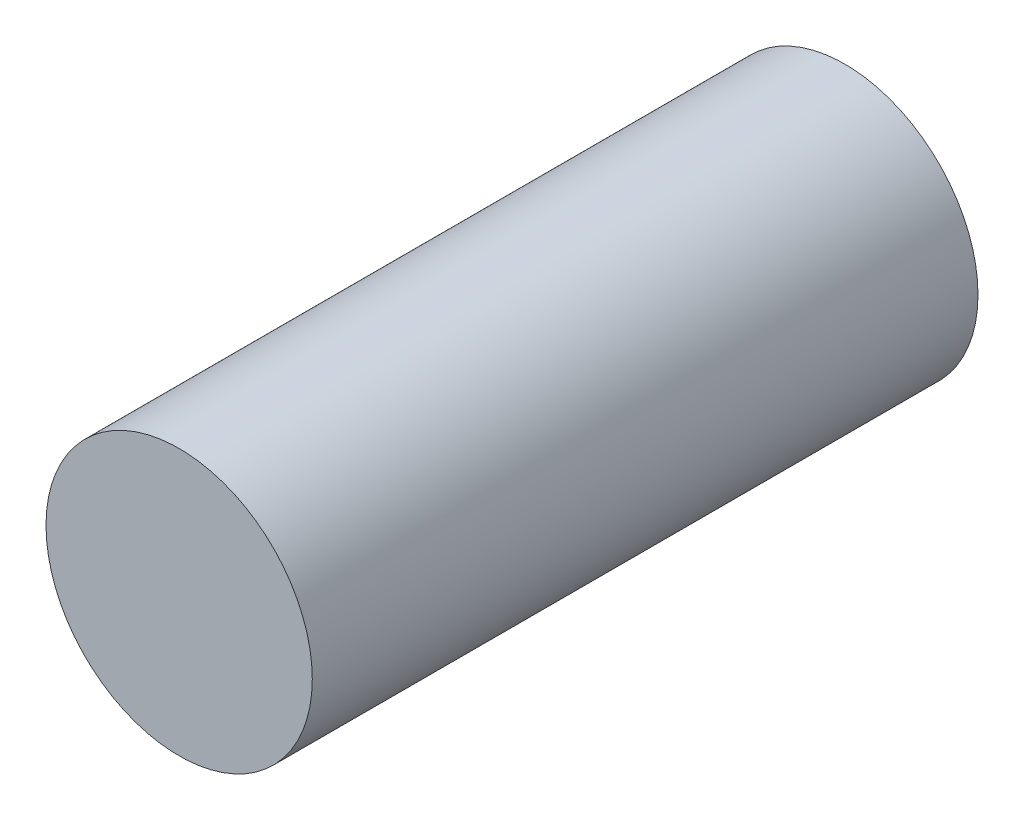
ISO-10303-21;
HEADER;
FILE_DESCRIPTION(('STEP AP214'),'2;1');
FILE_NAME('part.step','',(''),(''),'','','');
FILE_SCHEMA(('AUTOMOTIVE_DESIGN { 1 0 10303 214 1 1 1 1 }'));
ENDSEC;
DATA;
#1=APPLICATION_CONTEXT('core data for automotive mechanical design processes');
#2=APPLICATION_PROTOCOL_DEFINITION('international standard','automotive_design',2000,#1);
#3=PRODUCT_CONTEXT('',#1,'mechanical');
#4=PRODUCT('Part','Part','',(#3));
#5=PRODUCT_RELATED_PRODUCT_CATEGORY('part','',(#4));
#6=PRODUCT_DEFINITION_FORMATION('','',#4);
#7=PRODUCT_DEFINITION_CONTEXT('part definition',#1,'design');
#8=PRODUCT_DEFINITION('design','',#6,#7);
#9=PRODUCT_DEFINITION_SHAPE('','',#8);
#10=(LENGTH_UNIT() NAMED_UNIT(*) SI_UNIT(.MILLI.,.METRE.));
#11=(NAMED_UNIT(*) PLANE_ANGLE_UNIT() SI_UNIT($,.RADIAN.));
#12=(NAMED_UNIT(*) SI_UNIT($,.STERADIAN.) SOLID_ANGLE_UNIT());
#13=UNCERTAINTY_MEASURE_WITH_UNIT(LENGTH_MEASURE(1.E-05),#10,'distance_accuracy_value','');
#14=(GEOMETRIC_REPRESENTATION_CONTEXT(3) GLOBAL_UNCERTAINTY_ASSIGNED_CONTEXT((#13)) GLOBAL_UNIT_ASSIGNED_CONTEXT((#10,
#11,#12)) REPRESENTATION_CONTEXT('',''));
#15=CARTESIAN_POINT('',(0.,0.,0.));
#16=DIRECTION('',(0.,0.,1.));
#17=DIRECTION('',(1.,0.,0.));
#18=AXIS2_PLACEMENT_3D('',#15,#16,#17);
#19=CARTESIAN_POINT('',(-39.787128900219,20.3482744946834,100.));
#20=DIRECTION('',(0.,0.,-1.));
#21=DIRECTION('',(-1.,0.,0.));
#22=AXIS2_PLACEMENT_3D('',#19,#20,#21);
#23=CYLINDRICAL_SURFACE('',#22,20.);
#24=CARTESIAN_POINT('',(-39.787128900219,20.3482744946834,100.));
#25=DIRECTION('',(0.,0.,1.));
#26=DIRECTION('',(1.,0.,0.));
#27=AXIS2_PLACEMENT_3D('',#24,#25,#26);
#28=CIRCLE('',#27,20.);
#29=CARTESIAN_POINT('',(-19.787128900219,20.3482744946834,100.));
#30=VERTEX_POINT('',#29);
#31=EDGE_CURVE('E10',#30,#30,#28,.T.);
#32=ORIENTED_EDGE('',*,*,#31,.F.);
#33=EDGE_LOOP('',(#32));
#34=FACE_BOUND('',#33,.T.);
#35=CARTESIAN_POINT('',(-39.787128900219,20.3482744946834,0.));
#36=DIRECTION('',(0.,0.,1.));
#37=DIRECTION('',(1.,0.,0.));
#38=AXIS2_PLACEMENT_3D('',#35,#36,#37);
#39=CIRCLE('',#38,20.);
#40=CARTESIAN_POINT('',(-19.787128900219,20.3482744946834,0.));
#41=VERTEX_POINT('',#40);
#42=EDGE_CURVE('E40',#41,#41,#39,.T.);
#43=ORIENTED_EDGE('',*,*,#42,.T.);
#44=EDGE_LOOP('',(#43));
#45=FACE_BOUND('',#44,.T.);
#46=ADVANCED_FACE('F37',(#34,#45),#23,.T.);
#47=CARTESIAN_POINT('',(-39.787128900219,20.3482744946834,100.));
#48=DIRECTION('',(0.,0.,1.));
#49=DIRECTION('',(1.,0.,0.));
#50=AXIS2_PLACEMENT_3D('',#47,#48,#49);
#51=PLANE('',#50);
#52=ORIENTED_EDGE('',*,*,#31,.T.);
#53=EDGE_LOOP('',(#52));
#54=FACE_BOUND('',#53,.T.);
#55=ADVANCED_FACE('F54',(#54),#51,.T.);
#56=CARTESIAN_POINT('',(-39.787128900219,20.3482744946834,0.));
#57=DIRECTION('',(0.,0.,1.));
#58=DIRECTION('',(1.,0.,0.));
#59=AXIS2_PLACEMENT_3D('',#56,#57,#58);
#60=PLANE('',#59);
#61=ORIENTED_EDGE('',*,*,#42,.F.);
#62=EDGE_LOOP('',(#61));
#63=FACE_BOUND('',#62,.T.);
#64=ADVANCED_FACE('F52',(#63),#60,.F.);
#65=CLOSED_SHELL('',(#46,#55,#64));
#66=MANIFOLD_SOLID_BREP('B2',#65);
#67=ADVANCED_BREP_SHAPE_REPRESENTATION('',(#18,#66),#14);
#68=SHAPE_DEFINITION_REPRESENTATION(#9,#67);
ENDSEC;
END-ISO-10303-21;
